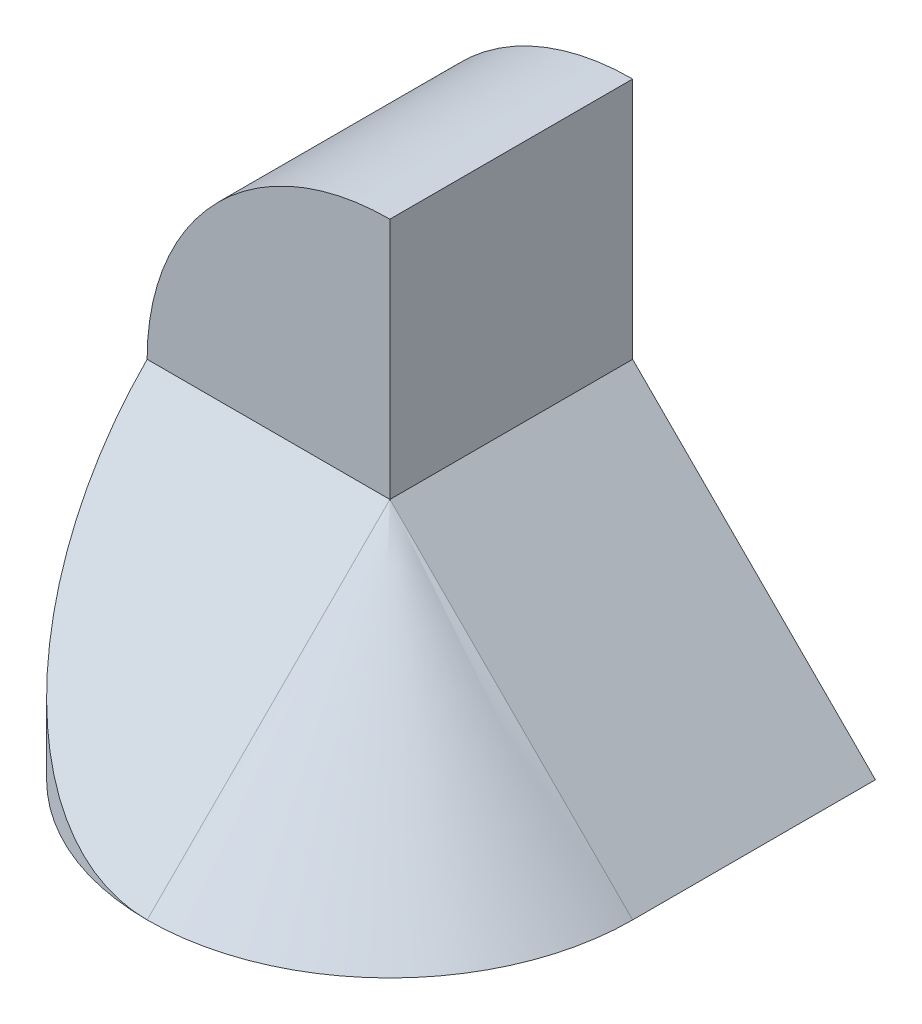
ISO-10303-21;
HEADER;
FILE_DESCRIPTION(('STEP AP214'),'2;1');
FILE_NAME('part.step','',(''),(''),'','','');
FILE_SCHEMA(('AUTOMOTIVE_DESIGN { 1 0 10303 214 1 1 1 1 }'));
ENDSEC;
DATA;
#1=APPLICATION_CONTEXT('core data for automotive mechanical design processes');
#2=APPLICATION_PROTOCOL_DEFINITION('international standard','automotive_design',2000,#1);
#3=PRODUCT_CONTEXT('',#1,'mechanical');
#4=PRODUCT('Part','Part','',(#3));
#5=PRODUCT_RELATED_PRODUCT_CATEGORY('part','',(#4));
#6=PRODUCT_DEFINITION_FORMATION('','',#4);
#7=PRODUCT_DEFINITION_CONTEXT('part definition',#1,'design');
#8=PRODUCT_DEFINITION('design','',#6,#7);
#9=PRODUCT_DEFINITION_SHAPE('','',#8);
#10=(LENGTH_UNIT() NAMED_UNIT(*) SI_UNIT(.MILLI.,.METRE.));
#11=(NAMED_UNIT(*) PLANE_ANGLE_UNIT() SI_UNIT($,.RADIAN.));
#12=(NAMED_UNIT(*) SI_UNIT($,.STERADIAN.) SOLID_ANGLE_UNIT());
#13=UNCERTAINTY_MEASURE_WITH_UNIT(LENGTH_MEASURE(1.E-05),#10,'distance_accuracy_value','');
#14=(GEOMETRIC_REPRESENTATION_CONTEXT(3) GLOBAL_UNCERTAINTY_ASSIGNED_CONTEXT((#13)) GLOBAL_UNIT_ASSIGNED_CONTEXT((#10,
#11,#12)) REPRESENTATION_CONTEXT('',''));
#15=CARTESIAN_POINT('',(0.,0.,0.));
#16=DIRECTION('',(0.,0.,1.));
#17=DIRECTION('',(1.,0.,0.));
#18=AXIS2_PLACEMENT_3D('',#15,#16,#17);
#19=CARTESIAN_POINT('',(1.99999999999999,0.,4.));
#20=DIRECTION('',(0.,1.,0.));
#21=DIRECTION('',(-1.,0.,0.));
#22=AXIS2_PLACEMENT_3D('',#19,#20,#21);
#23=PLANE('',#22);
#24=CARTESIAN_POINT('',(2.,0.,2.));
#25=DIRECTION('',(0.,1.,0.));
#26=DIRECTION('',(-1.,0.,0.));
#27=AXIS2_PLACEMENT_3D('',#24,#25,#26);
#28=CIRCLE('',#27,2.);
#29=CARTESIAN_POINT('',(1.99999999999999,0.,4.));
#30=VERTEX_POINT('',#29);
#31=CARTESIAN_POINT('',(4.,0.,2.));
#32=VERTEX_POINT('',#31);
#33=EDGE_CURVE('E11',#30,#32,#28,.T.);
#34=ORIENTED_EDGE('',*,*,#33,.F.);
#35=CARTESIAN_POINT('',(2.,0.,2.));
#36=DIRECTION('',(0.,1.,0.));
#37=DIRECTION('',(0.,0.,1.));
#38=AXIS2_PLACEMENT_3D('',#35,#36,#37);
#39=CIRCLE('',#38,2.);
#40=CARTESIAN_POINT('',(0.,0.,2.));
#41=VERTEX_POINT('',#40);
#42=EDGE_CURVE('E115',#41,#30,#39,.T.);
#43=ORIENTED_EDGE('',*,*,#42,.F.);
#44=DIRECTION('',(0.,0.,-1.));
#45=VECTOR('',#44,1.);
#46=CARTESIAN_POINT('',(0.,0.,2.));
#47=LINE('',#46,#45);
#48=CARTESIAN_POINT('',(0.,0.,1.));
#49=VERTEX_POINT('',#48);
#50=EDGE_CURVE('E113',#41,#49,#47,.T.);
#51=ORIENTED_EDGE('',*,*,#50,.T.);
#52=DIRECTION('',(-1.,0.,0.));
#53=VECTOR('',#52,1.);
#54=CARTESIAN_POINT('',(1.99999999999999,0.,1.));
#55=LINE('',#54,#53);
#56=CARTESIAN_POINT('',(1.99999999999999,0.,1.));
#57=VERTEX_POINT('',#56);
#58=EDGE_CURVE('E104',#57,#49,#55,.T.);
#59=ORIENTED_EDGE('',*,*,#58,.F.);
#60=DIRECTION('',(0.,0.,1.));
#61=VECTOR('',#60,1.);
#62=CARTESIAN_POINT('',(1.99999999999999,0.,4.));
#63=LINE('',#62,#61);
#64=CARTESIAN_POINT('',(1.99999999999999,0.,0.));
#65=VERTEX_POINT('',#64);
#66=EDGE_CURVE('E90',#65,#57,#63,.T.);
#67=ORIENTED_EDGE('',*,*,#66,.F.);
#68=DIRECTION('',(-1.,0.,0.));
#69=VECTOR('',#68,1.);
#70=CARTESIAN_POINT('',(2.,0.,0.));
#71=LINE('',#70,#69);
#72=CARTESIAN_POINT('',(4.,0.,0.));
#73=VERTEX_POINT('',#72);
#74=EDGE_CURVE('E141',#73,#65,#71,.T.);
#75=ORIENTED_EDGE('',*,*,#74,.F.);
#76=DIRECTION('',(0.,0.,1.));
#77=VECTOR('',#76,1.);
#78=CARTESIAN_POINT('',(4.,0.,0.));
#79=LINE('',#78,#77);
#80=EDGE_CURVE('E145',#73,#32,#79,.T.);
#81=ORIENTED_EDGE('',*,*,#80,.T.);
#82=EDGE_LOOP('',(#34,#43,#51,#59,#67,#75,#81));
#83=FACE_BOUND('',#82,.T.);
#84=ADVANCED_FACE('F33',(#83),#23,.F.);
#85=CARTESIAN_POINT('',(2.,0.,2.));
#86=DIRECTION('',(0.,-1.,0.));
#87=DIRECTION('',(1.,0.,0.));
#88=AXIS2_PLACEMENT_3D('',#85,#86,#87);
#89=CONICAL_SURFACE('',#88,2.,0.785398163397448);
#90=DIRECTION('',(0.,0.707106781186548,-0.707106781186547));
#91=VECTOR('',#90,1.);
#92=CARTESIAN_POINT('',(2.,2.,2.));
#93=LINE('',#92,#91);
#94=CARTESIAN_POINT('',(2.,2.,2.));
#95=VERTEX_POINT('',#94);
#96=EDGE_CURVE('E40',#30,#95,#93,.T.);
#97=ORIENTED_EDGE('',*,*,#96,.F.);
#98=ORIENTED_EDGE('',*,*,#33,.T.);
#99=DIRECTION('',(-0.707106781186548,0.707106781186547,0.));
#100=VECTOR('',#99,1.);
#101=CARTESIAN_POINT('',(2.,2.,2.));
#102=LINE('',#101,#100);
#103=EDGE_CURVE('E47',#32,#95,#102,.T.);
#104=ORIENTED_EDGE('',*,*,#103,.T.);
#105=EDGE_LOOP('',(#97,#98,#104));
#106=FACE_BOUND('',#105,.T.);
#107=ADVANCED_FACE('F161',(#106),#89,.T.);
#108=CARTESIAN_POINT('',(4.,0.,0.));
#109=DIRECTION('',(-0.707106781186547,-0.707106781186547,0.));
#110=DIRECTION('',(0.707106781186548,-0.707106781186548,0.));
#111=AXIS2_PLACEMENT_3D('',#108,#109,#110);
#112=PLANE('',#111);
#113=ORIENTED_EDGE('',*,*,#103,.F.);
#114=ORIENTED_EDGE('',*,*,#80,.F.);
#115=DIRECTION('',(0.707106781186548,-0.707106781186548,0.));
#116=VECTOR('',#115,1.);
#117=CARTESIAN_POINT('',(4.,0.,0.));
#118=LINE('',#117,#116);
#119=CARTESIAN_POINT('',(2.,2.,0.));
#120=VERTEX_POINT('',#119);
#121=EDGE_CURVE('E139',#120,#73,#118,.T.);
#122=ORIENTED_EDGE('',*,*,#121,.F.);
#123=DIRECTION('',(0.,0.,1.));
#124=VECTOR('',#123,1.);
#125=CARTESIAN_POINT('',(2.,2.,0.));
#126=LINE('',#125,#124);
#127=EDGE_CURVE('E143',#120,#95,#126,.T.);
#128=ORIENTED_EDGE('',*,*,#127,.T.);
#129=EDGE_LOOP('',(#113,#114,#122,#128));
#130=FACE_BOUND('',#129,.T.);
#131=ADVANCED_FACE('F160',(#130),#112,.F.);
#132=CARTESIAN_POINT('',(0.,0.,0.));
#133=DIRECTION('',(0.,0.,1.));
#134=DIRECTION('',(1.,0.,0.));
#135=AXIS2_PLACEMENT_3D('',#132,#133,#134);
#136=PLANE('',#135);
#137=ORIENTED_EDGE('',*,*,#121,.T.);
#138=ORIENTED_EDGE('',*,*,#74,.T.);
#139=CARTESIAN_POINT('',(2.,2.,0.));
#140=DIRECTION('',(0.,0.,1.));
#141=DIRECTION('',(1.,0.,0.));
#142=AXIS2_PLACEMENT_3D('',#139,#140,#141);
#143=CIRCLE('',#142,2.);
#144=CARTESIAN_POINT('',(2.,4.,0.));
#145=VERTEX_POINT('',#144);
#146=EDGE_CURVE('E97',#145,#65,#143,.T.);
#147=ORIENTED_EDGE('',*,*,#146,.F.);
#148=DIRECTION('',(0.,1.,0.));
#149=VECTOR('',#148,1.);
#150=CARTESIAN_POINT('',(2.,0.,0.));
#151=LINE('',#150,#149);
#152=EDGE_CURVE('E55',#120,#145,#151,.T.);
#153=ORIENTED_EDGE('',*,*,#152,.F.);
#154=EDGE_LOOP('',(#137,#138,#147,#153));
#155=FACE_BOUND('',#154,.T.);
#156=ADVANCED_FACE('F162',(#155),#136,.F.);
#157=CARTESIAN_POINT('',(2.,0.,2.));
#158=DIRECTION('',(-1.,0.,0.));
#159=DIRECTION('',(0.,-1.,0.));
#160=AXIS2_PLACEMENT_3D('',#157,#158,#159);
#161=PLANE('',#160);
#162=DIRECTION('',(0.,1.,0.));
#163=VECTOR('',#162,1.);
#164=CARTESIAN_POINT('',(2.,0.,2.));
#165=LINE('',#164,#163);
#166=CARTESIAN_POINT('',(2.,4.,2.));
#167=VERTEX_POINT('',#166);
#168=EDGE_CURVE('E124',#95,#167,#165,.T.);
#169=ORIENTED_EDGE('',*,*,#168,.F.);
#170=ORIENTED_EDGE('',*,*,#127,.F.);
#171=ORIENTED_EDGE('',*,*,#152,.T.);
#172=DIRECTION('',(0.,0.,-1.));
#173=VECTOR('',#172,1.);
#174=CARTESIAN_POINT('',(2.,4.,2.));
#175=LINE('',#174,#173);
#176=EDGE_CURVE('E133',#167,#145,#175,.T.);
#177=ORIENTED_EDGE('',*,*,#176,.F.);
#178=EDGE_LOOP('',(#169,#170,#171,#177));
#179=FACE_BOUND('',#178,.T.);
#180=ADVANCED_FACE('F158',(#179),#161,.F.);
#181=CARTESIAN_POINT('',(2.,2.,2.));
#182=DIRECTION('',(0.,0.,1.));
#183=DIRECTION('',(1.,0.,0.));
#184=AXIS2_PLACEMENT_3D('',#181,#182,#183);
#185=PLANE('',#184);
#186=CARTESIAN_POINT('',(2.,2.,2.));
#187=DIRECTION('',(0.,0.,1.));
#188=DIRECTION('',(1.,0.,0.));
#189=AXIS2_PLACEMENT_3D('',#186,#187,#188);
#190=CIRCLE('',#189,2.);
#191=CARTESIAN_POINT('',(0.,2.,2.));
#192=VERTEX_POINT('',#191);
#193=EDGE_CURVE('E126',#167,#192,#190,.T.);
#194=ORIENTED_EDGE('',*,*,#193,.T.);
#195=DIRECTION('',(1.,0.,0.));
#196=VECTOR('',#195,1.);
#197=CARTESIAN_POINT('',(0.,2.,1.99999999999999));
#198=LINE('',#197,#196);
#199=EDGE_CURVE('E121',#192,#95,#198,.T.);
#200=ORIENTED_EDGE('',*,*,#199,.T.);
#201=ORIENTED_EDGE('',*,*,#168,.T.);
#202=EDGE_LOOP('',(#194,#200,#201));
#203=FACE_BOUND('',#202,.T.);
#204=ADVANCED_FACE('F154',(#203),#185,.T.);
#205=CARTESIAN_POINT('',(0.,2.,2.));
#206=DIRECTION('',(1.,0.,0.));
#207=DIRECTION('',(0.,1.,0.));
#208=AXIS2_PLACEMENT_3D('',#205,#206,#207);
#209=PLANE('',#208);
#210=DIRECTION('',(0.,0.,-1.));
#211=VECTOR('',#210,1.);
#212=CARTESIAN_POINT('',(0.,2.,2.));
#213=LINE('',#212,#211);
#214=CARTESIAN_POINT('',(0.,2.,1.));
#215=VERTEX_POINT('',#214);
#216=EDGE_CURVE('E129',#192,#215,#213,.T.);
#217=ORIENTED_EDGE('',*,*,#216,.T.);
#218=DIRECTION('',(0.,1.,0.));
#219=VECTOR('',#218,1.);
#220=CARTESIAN_POINT('',(0.,0.,1.));
#221=LINE('',#220,#219);
#222=EDGE_CURVE('E106',#49,#215,#221,.T.);
#223=ORIENTED_EDGE('',*,*,#222,.F.);
#224=ORIENTED_EDGE('',*,*,#50,.F.);
#225=DIRECTION('',(0.,-1.,0.));
#226=VECTOR('',#225,1.);
#227=CARTESIAN_POINT('',(0.,2.,2.));
#228=LINE('',#227,#226);
#229=EDGE_CURVE('E119',#192,#41,#228,.T.);
#230=ORIENTED_EDGE('',*,*,#229,.F.);
#231=EDGE_LOOP('',(#217,#223,#224,#230));
#232=FACE_BOUND('',#231,.T.);
#233=ADVANCED_FACE('F204',(#232),#209,.F.);
#234=CARTESIAN_POINT('',(2.,2.,2.));
#235=DIRECTION('',(0.,0.,-1.));
#236=DIRECTION('',(-1.,0.,0.));
#237=AXIS2_PLACEMENT_3D('',#234,#235,#236);
#238=CYLINDRICAL_SURFACE('',#237,2.);
#239=ORIENTED_EDGE('',*,*,#146,.T.);
#240=ORIENTED_EDGE('',*,*,#66,.T.);
#241=CARTESIAN_POINT('',(2.,2.,1.));
#242=DIRECTION('',(0.,0.,1.));
#243=DIRECTION('',(1.,0.,0.));
#244=AXIS2_PLACEMENT_3D('',#241,#242,#243);
#245=CIRCLE('',#244,2.);
#246=EDGE_CURVE('E94',#215,#57,#245,.T.);
#247=ORIENTED_EDGE('',*,*,#246,.F.);
#248=ORIENTED_EDGE('',*,*,#216,.F.);
#249=ORIENTED_EDGE('',*,*,#193,.F.);
#250=ORIENTED_EDGE('',*,*,#176,.T.);
#251=EDGE_LOOP('',(#239,#240,#247,#248,#249,#250));
#252=FACE_BOUND('',#251,.T.);
#253=ADVANCED_FACE('F92',(#252),#238,.T.);
#254=CARTESIAN_POINT('',(0.,0.,3.99999999999999));
#255=DIRECTION('',(0.,-0.707106781186547,-0.707106781186548));
#256=DIRECTION('',(0.,0.707106781186548,-0.707106781186547));
#257=AXIS2_PLACEMENT_3D('',#254,#255,#256);
#258=PLANE('',#257);
#259=ORIENTED_EDGE('',*,*,#199,.F.);
#260=CARTESIAN_POINT('',(2.,2.,2.));
#261=DIRECTION('',(0.,-0.707106781186547,-0.707106781186548));
#262=DIRECTION('',(0.,-0.707106781186548,0.707106781186547));
#263=AXIS2_PLACEMENT_3D('',#260,#261,#262);
#264=ELLIPSE('',#263,2.82842712474618,2.);
#265=EDGE_CURVE('E136',#192,#30,#264,.F.);
#266=ORIENTED_EDGE('',*,*,#265,.T.);
#267=ORIENTED_EDGE('',*,*,#96,.T.);
#268=EDGE_LOOP('',(#259,#266,#267));
#269=FACE_BOUND('',#268,.T.);
#270=ADVANCED_FACE('F150',(#269),#258,.F.);
#271=CARTESIAN_POINT('',(2.,2.,2.));
#272=DIRECTION('',(0.,-1.,0.));
#273=DIRECTION('',(0.,0.,-1.));
#274=AXIS2_PLACEMENT_3D('',#271,#272,#273);
#275=CYLINDRICAL_SURFACE('',#274,2.);
#276=ORIENTED_EDGE('',*,*,#229,.T.);
#277=ORIENTED_EDGE('',*,*,#42,.T.);
#278=ORIENTED_EDGE('',*,*,#265,.F.);
#279=EDGE_LOOP('',(#276,#277,#278));
#280=FACE_BOUND('',#279,.T.);
#281=ADVANCED_FACE('F231',(#280),#275,.T.);
#282=CARTESIAN_POINT('',(2.,2.,1.));
#283=DIRECTION('',(0.,0.,1.));
#284=DIRECTION('',(1.,0.,0.));
#285=AXIS2_PLACEMENT_3D('',#282,#283,#284);
#286=PLANE('',#285);
#287=ORIENTED_EDGE('',*,*,#246,.T.);
#288=ORIENTED_EDGE('',*,*,#58,.T.);
#289=ORIENTED_EDGE('',*,*,#222,.T.);
#290=EDGE_LOOP('',(#287,#288,#289));
#291=FACE_BOUND('',#290,.T.);
#292=ADVANCED_FACE('F103',(#291),#286,.F.);
#293=CLOSED_SHELL('',(#84,#107,#131,#156,#180,#204,#233,#253,#270,#281,#292));
#294=MANIFOLD_SOLID_BREP('B2',#293);
#295=ADVANCED_BREP_SHAPE_REPRESENTATION('',(#18,#294),#14);
#296=SHAPE_DEFINITION_REPRESENTATION(#9,#295);
ENDSEC;
END-ISO-10303-21;
